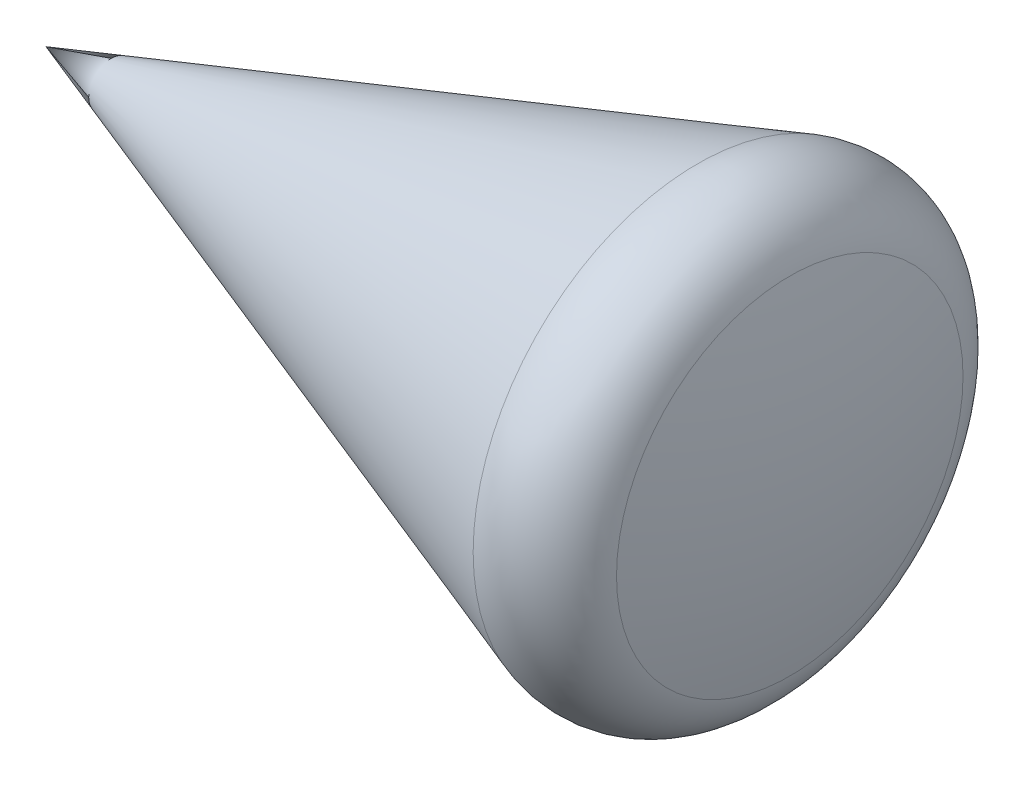
ISO-10303-21;
HEADER;
FILE_DESCRIPTION(('STEP AP214'),'2;1');
FILE_NAME('part.step','',(''),(''),'','','');
FILE_SCHEMA(('AUTOMOTIVE_DESIGN { 1 0 10303 214 1 1 1 1 }'));
ENDSEC;
DATA;
#1=APPLICATION_CONTEXT('core data for automotive mechanical design processes');
#2=APPLICATION_PROTOCOL_DEFINITION('international standard','automotive_design',2000,#1);
#3=PRODUCT_CONTEXT('',#1,'mechanical');
#4=PRODUCT('Part','Part','',(#3));
#5=PRODUCT_RELATED_PRODUCT_CATEGORY('part','',(#4));
#6=PRODUCT_DEFINITION_FORMATION('','',#4);
#7=PRODUCT_DEFINITION_CONTEXT('part definition',#1,'design');
#8=PRODUCT_DEFINITION('design','',#6,#7);
#9=PRODUCT_DEFINITION_SHAPE('','',#8);
#10=(LENGTH_UNIT() NAMED_UNIT(*) SI_UNIT(.MILLI.,.METRE.));
#11=(NAMED_UNIT(*) PLANE_ANGLE_UNIT() SI_UNIT($,.RADIAN.));
#12=(NAMED_UNIT(*) SI_UNIT($,.STERADIAN.) SOLID_ANGLE_UNIT());
#13=UNCERTAINTY_MEASURE_WITH_UNIT(LENGTH_MEASURE(1.E-05),#10,'distance_accuracy_value','');
#14=(GEOMETRIC_REPRESENTATION_CONTEXT(3) GLOBAL_UNCERTAINTY_ASSIGNED_CONTEXT((#13)) GLOBAL_UNIT_ASSIGNED_CONTEXT((#10,
#11,#12)) REPRESENTATION_CONTEXT('',''));
#15=CARTESIAN_POINT('',(0.,0.,0.));
#16=DIRECTION('',(0.,0.,1.));
#17=DIRECTION('',(1.,0.,0.));
#18=AXIS2_PLACEMENT_3D('',#15,#16,#17);
#19=CARTESIAN_POINT('',(5502.11387304951,0.,0.));
#20=DIRECTION('',(1.,0.,0.));
#21=DIRECTION('',(0.,0.,-1.));
#22=AXIS2_PLACEMENT_3D('',#19,#20,#21);
#23=CONICAL_SURFACE('',#22,1894.5297379551,0.331612557878923);
#24=CARTESIAN_POINT('',(0.,0.,0.));
#25=VERTEX_POINT('',#24);
#26=VERTEX_LOOP('',#25);
#27=FACE_BOUND('',#26,.T.);
#28=CARTESIAN_POINT('',(5502.11387304951,0.,0.));
#29=DIRECTION('',(-1.,0.,0.));
#30=DIRECTION('',(0.,0.,1.));
#31=AXIS2_PLACEMENT_3D('',#28,#29,#30);
#32=CIRCLE('',#31,1894.5297379551);
#33=CARTESIAN_POINT('',(5502.11387304951,0.,1894.5297379551));
#34=VERTEX_POINT('',#33);
#35=EDGE_CURVE('E11',#34,#34,#32,.T.);
#36=ORIENTED_EDGE('',*,*,#35,.T.);
#37=EDGE_LOOP('',(#36));
#38=FACE_BOUND('',#37,.T.);
#39=ADVANCED_FACE('F31',(#27,#38),#23,.T.);
#40=CARTESIAN_POINT('',(5697.4547657238,0.,0.));
#41=DIRECTION('',(-1.,0.,0.));
#42=DIRECTION('',(0.,0.,1.));
#43=AXIS2_PLACEMENT_3D('',#40,#41,#42);
#44=TOROIDAL_SURFACE('',#43,1327.21859259551,599.999999999999);
#45=ORIENTED_EDGE('',*,*,#35,.F.);
#46=EDGE_LOOP('',(#45));
#47=FACE_BOUND('',#46,.T.);
#48=CARTESIAN_POINT('',(6281.80910066983,0.,0.));
#49=DIRECTION('',(-1.,0.,0.));
#50=DIRECTION('',(0.,0.,1.));
#51=AXIS2_PLACEMENT_3D('',#48,#49,#50);
#52=CIRCLE('',#51,1463.34357645146);
#53=CARTESIAN_POINT('',(6281.80910066983,0.,1463.34357645146));
#54=VERTEX_POINT('',#53);
#55=EDGE_CURVE('E37',#54,#54,#52,.T.);
#56=ORIENTED_EDGE('',*,*,#55,.T.);
#57=EDGE_LOOP('',(#56));
#58=FACE_BOUND('',#57,.T.);
#59=ADVANCED_FACE('F42',(#47,#58),#44,.T.);
#60=CARTESIAN_POINT('',(0.,0.,0.));
#61=DIRECTION('',(-1.,0.,0.));
#62=DIRECTION('',(0.,0.,-1.));
#63=AXIS2_PLACEMENT_3D('',#60,#61,#62);
#64=SPHERICAL_SURFACE('',#63,6450.);
#65=ORIENTED_EDGE('',*,*,#55,.F.);
#66=EDGE_LOOP('',(#65));
#67=FACE_BOUND('',#66,.T.);
#68=ADVANCED_FACE('F47',(#67),#64,.T.);
#69=CLOSED_SHELL('',(#39,#59,#68));
#70=MANIFOLD_SOLID_BREP('B2',#69);
#71=ADVANCED_BREP_SHAPE_REPRESENTATION('',(#18,#70),#14);
#72=SHAPE_DEFINITION_REPRESENTATION(#9,#71);
ENDSEC;
END-ISO-10303-21;
